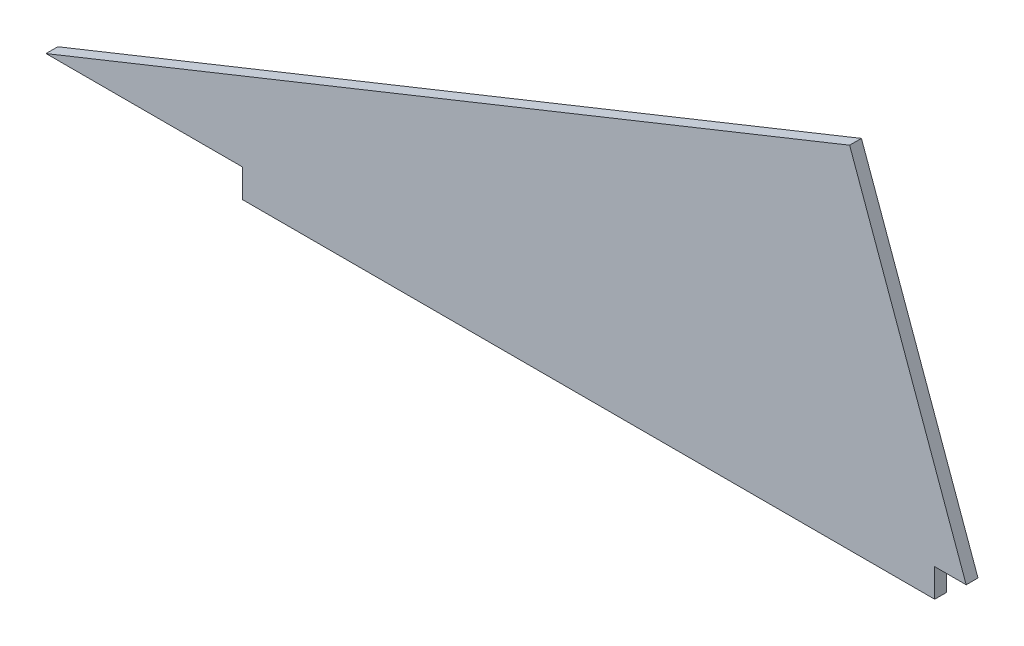
ISO-10303-21;
HEADER;
FILE_DESCRIPTION(('STEP AP214'),'2;1');
FILE_NAME('part.step','',(''),(''),'','','');
FILE_SCHEMA(('AUTOMOTIVE_DESIGN { 1 0 10303 214 1 1 1 1 }'));
ENDSEC;
DATA;
#1=APPLICATION_CONTEXT('core data for automotive mechanical design processes');
#2=APPLICATION_PROTOCOL_DEFINITION('international standard','automotive_design',2000,#1);
#3=PRODUCT_CONTEXT('',#1,'mechanical');
#4=PRODUCT('Part','Part','',(#3));
#5=PRODUCT_RELATED_PRODUCT_CATEGORY('part','',(#4));
#6=PRODUCT_DEFINITION_FORMATION('','',#4);
#7=PRODUCT_DEFINITION_CONTEXT('part definition',#1,'design');
#8=PRODUCT_DEFINITION('design','',#6,#7);
#9=PRODUCT_DEFINITION_SHAPE('','',#8);
#10=(LENGTH_UNIT() NAMED_UNIT(*) SI_UNIT(.MILLI.,.METRE.));
#11=(NAMED_UNIT(*) PLANE_ANGLE_UNIT() SI_UNIT($,.RADIAN.));
#12=(NAMED_UNIT(*) SI_UNIT($,.STERADIAN.) SOLID_ANGLE_UNIT());
#13=UNCERTAINTY_MEASURE_WITH_UNIT(LENGTH_MEASURE(1.E-05),#10,'distance_accuracy_value','');
#14=(GEOMETRIC_REPRESENTATION_CONTEXT(3) GLOBAL_UNCERTAINTY_ASSIGNED_CONTEXT((#13)) GLOBAL_UNIT_ASSIGNED_CONTEXT((#10,
#11,#12)) REPRESENTATION_CONTEXT('',''));
#15=CARTESIAN_POINT('',(0.,0.,0.));
#16=DIRECTION('',(0.,0.,1.));
#17=DIRECTION('',(1.,0.,0.));
#18=AXIS2_PLACEMENT_3D('',#15,#16,#17);
#19=CARTESIAN_POINT('',(358.3,-20.340021117244,4.76));
#20=DIRECTION('',(-1.,0.,0.));
#21=DIRECTION('',(0.,0.,1.));
#22=AXIS2_PLACEMENT_3D('',#19,#20,#21);
#23=PLANE('',#22);
#24=DIRECTION('',(0.,1.,0.));
#25=VECTOR('',#24,1.);
#26=CARTESIAN_POINT('',(358.3,-20.340021117244,0.));
#27=LINE('',#26,#25);
#28=CARTESIAN_POINT('',(358.3,-31.740021117244,0.));
#29=VERTEX_POINT('',#28);
#30=CARTESIAN_POINT('',(358.3,-20.340021117244,0.));
#31=VERTEX_POINT('',#30);
#32=EDGE_CURVE('E123',#29,#31,#27,.T.);
#33=ORIENTED_EDGE('',*,*,#32,.T.);
#34=DIRECTION('',(0.,0.,-1.));
#35=VECTOR('',#34,1.);
#36=CARTESIAN_POINT('',(358.3,-20.340021117244,4.76));
#37=LINE('',#36,#35);
#38=CARTESIAN_POINT('',(358.3,-20.340021117244,4.76));
#39=VERTEX_POINT('',#38);
#40=EDGE_CURVE('E11',#39,#31,#37,.T.);
#41=ORIENTED_EDGE('',*,*,#40,.F.);
#42=DIRECTION('',(0.,1.,0.));
#43=VECTOR('',#42,1.);
#44=CARTESIAN_POINT('',(358.3,-20.340021117244,4.76));
#45=LINE('',#44,#43);
#46=CARTESIAN_POINT('',(358.3,-31.740021117244,4.76));
#47=VERTEX_POINT('',#46);
#48=EDGE_CURVE('E135',#47,#39,#45,.T.);
#49=ORIENTED_EDGE('',*,*,#48,.F.);
#50=DIRECTION('',(0.,0.,-1.));
#51=VECTOR('',#50,1.);
#52=CARTESIAN_POINT('',(358.3,-31.740021117244,4.76));
#53=LINE('',#52,#51);
#54=EDGE_CURVE('E119',#47,#29,#53,.T.);
#55=ORIENTED_EDGE('',*,*,#54,.T.);
#56=EDGE_LOOP('',(#33,#41,#49,#55));
#57=FACE_BOUND('',#56,.T.);
#58=ADVANCED_FACE('F33',(#57),#23,.F.);
#59=CARTESIAN_POINT('',(371.,-20.340021117244,4.76));
#60=DIRECTION('',(0.,1.,0.));
#61=DIRECTION('',(0.,0.,1.));
#62=AXIS2_PLACEMENT_3D('',#59,#60,#61);
#63=PLANE('',#62);
#64=DIRECTION('',(1.,0.,0.));
#65=VECTOR('',#64,1.);
#66=CARTESIAN_POINT('',(371.,-20.340021117244,0.));
#67=LINE('',#66,#65);
#68=CARTESIAN_POINT('',(371.,-20.340021117244,0.));
#69=VERTEX_POINT('',#68);
#70=EDGE_CURVE('E126',#31,#69,#67,.T.);
#71=ORIENTED_EDGE('',*,*,#70,.T.);
#72=DIRECTION('',(0.,0.,-1.));
#73=VECTOR('',#72,1.);
#74=CARTESIAN_POINT('',(371.,-20.340021117244,4.76));
#75=LINE('',#74,#73);
#76=CARTESIAN_POINT('',(371.,-20.340021117244,4.76));
#77=VERTEX_POINT('',#76);
#78=EDGE_CURVE('E41',#77,#69,#75,.T.);
#79=ORIENTED_EDGE('',*,*,#78,.F.);
#80=DIRECTION('',(1.,0.,0.));
#81=VECTOR('',#80,1.);
#82=CARTESIAN_POINT('',(371.,-20.340021117244,4.76));
#83=LINE('',#82,#81);
#84=EDGE_CURVE('E89',#39,#77,#83,.T.);
#85=ORIENTED_EDGE('',*,*,#84,.F.);
#86=ORIENTED_EDGE('',*,*,#40,.T.);
#87=EDGE_LOOP('',(#71,#79,#85,#86));
#88=FACE_BOUND('',#87,.T.);
#89=ADVANCED_FACE('F160',(#88),#63,.F.);
#90=CARTESIAN_POINT('',(371.,-20.340021117244,4.76));
#91=DIRECTION('',(-0.940425446769995,-0.339999969216844,0.));
#92=DIRECTION('',(0.339999969216844,-0.940425446769995,0.));
#93=AXIS2_PLACEMENT_3D('',#90,#91,#92);
#94=PLANE('',#93);
#95=DIRECTION('',(-0.339999969216844,0.940425446769995,0.));
#96=VECTOR('',#95,1.);
#97=CARTESIAN_POINT('',(371.,-20.340021117244,0.));
#98=LINE('',#97,#96);
#99=CARTESIAN_POINT('',(324.,109.659978882756,0.));
#100=VERTEX_POINT('',#99);
#101=EDGE_CURVE('E128',#69,#100,#98,.T.);
#102=ORIENTED_EDGE('',*,*,#101,.T.);
#103=DIRECTION('',(0.,0.,-1.));
#104=VECTOR('',#103,1.);
#105=CARTESIAN_POINT('',(324.,109.659978882756,4.76));
#106=LINE('',#105,#104);
#107=CARTESIAN_POINT('',(324.,109.659978882756,4.76));
#108=VERTEX_POINT('',#107);
#109=EDGE_CURVE('E139',#108,#100,#106,.T.);
#110=ORIENTED_EDGE('',*,*,#109,.F.);
#111=DIRECTION('',(-0.339999969216844,0.940425446769995,0.));
#112=VECTOR('',#111,1.);
#113=CARTESIAN_POINT('',(371.,-20.340021117244,4.76));
#114=LINE('',#113,#112);
#115=EDGE_CURVE('E147',#77,#108,#114,.T.);
#116=ORIENTED_EDGE('',*,*,#115,.F.);
#117=ORIENTED_EDGE('',*,*,#78,.T.);
#118=EDGE_LOOP('',(#102,#110,#116,#117));
#119=FACE_BOUND('',#118,.T.);
#120=ADVANCED_FACE('F145',(#119),#94,.F.);
#121=CARTESIAN_POINT('',(324.,109.659978882756,4.76));
#122=DIRECTION('',(0.372378206798175,-0.928081069250836,0.));
#123=DIRECTION('',(0.928081069250836,0.372378206798175,0.));
#124=AXIS2_PLACEMENT_3D('',#121,#122,#123);
#125=PLANE('',#124);
#126=DIRECTION('',(-0.928081069250836,-0.372378206798175,0.));
#127=VECTOR('',#126,1.);
#128=CARTESIAN_POINT('',(324.,109.659978882756,0.));
#129=LINE('',#128,#127);
#130=CARTESIAN_POINT('',(0.,-20.3400211172441,0.));
#131=VERTEX_POINT('',#130);
#132=EDGE_CURVE('E130',#100,#131,#129,.T.);
#133=ORIENTED_EDGE('',*,*,#132,.T.);
#134=DIRECTION('',(0.,0.,-1.));
#135=VECTOR('',#134,1.);
#136=CARTESIAN_POINT('',(0.,-20.3400211172441,4.76));
#137=LINE('',#136,#135);
#138=CARTESIAN_POINT('',(0.,-20.3400211172441,4.76));
#139=VERTEX_POINT('',#138);
#140=EDGE_CURVE('E114',#139,#131,#137,.T.);
#141=ORIENTED_EDGE('',*,*,#140,.F.);
#142=DIRECTION('',(-0.928081069250836,-0.372378206798175,0.));
#143=VECTOR('',#142,1.);
#144=CARTESIAN_POINT('',(324.,109.659978882756,4.76));
#145=LINE('',#144,#143);
#146=EDGE_CURVE('E105',#108,#139,#145,.T.);
#147=ORIENTED_EDGE('',*,*,#146,.F.);
#148=ORIENTED_EDGE('',*,*,#109,.T.);
#149=EDGE_LOOP('',(#133,#141,#147,#148));
#150=FACE_BOUND('',#149,.T.);
#151=ADVANCED_FACE('F153',(#150),#125,.F.);
#152=CARTESIAN_POINT('',(79.2999999999999,-20.3400211172441,4.76));
#153=DIRECTION('',(0.,1.,0.));
#154=DIRECTION('',(-1.,0.,0.));
#155=AXIS2_PLACEMENT_3D('',#152,#153,#154);
#156=PLANE('',#155);
#157=DIRECTION('',(1.,0.,0.));
#158=VECTOR('',#157,1.);
#159=CARTESIAN_POINT('',(79.2999999999999,-20.3400211172441,0.));
#160=LINE('',#159,#158);
#161=CARTESIAN_POINT('',(79.2999999999999,-20.3400211172441,0.));
#162=VERTEX_POINT('',#161);
#163=EDGE_CURVE('E113',#131,#162,#160,.T.);
#164=ORIENTED_EDGE('',*,*,#163,.T.);
#165=DIRECTION('',(0.,0.,-1.));
#166=VECTOR('',#165,1.);
#167=CARTESIAN_POINT('',(79.2999999999999,-20.3400211172441,4.76));
#168=LINE('',#167,#166);
#169=CARTESIAN_POINT('',(79.2999999999999,-20.3400211172441,4.76));
#170=VERTEX_POINT('',#169);
#171=EDGE_CURVE('E110',#170,#162,#168,.T.);
#172=ORIENTED_EDGE('',*,*,#171,.F.);
#173=DIRECTION('',(1.,0.,0.));
#174=VECTOR('',#173,1.);
#175=CARTESIAN_POINT('',(79.2999999999999,-20.3400211172441,4.76));
#176=LINE('',#175,#174);
#177=EDGE_CURVE('E99',#139,#170,#176,.T.);
#178=ORIENTED_EDGE('',*,*,#177,.F.);
#179=ORIENTED_EDGE('',*,*,#140,.T.);
#180=EDGE_LOOP('',(#164,#172,#178,#179));
#181=FACE_BOUND('',#180,.T.);
#182=ADVANCED_FACE('F111',(#181),#156,.F.);
#183=CARTESIAN_POINT('',(79.2999999999999,-31.740021117244,4.76));
#184=DIRECTION('',(1.,0.,0.));
#185=DIRECTION('',(0.,0.,-1.));
#186=AXIS2_PLACEMENT_3D('',#183,#184,#185);
#187=PLANE('',#186);
#188=DIRECTION('',(0.,-1.,0.));
#189=VECTOR('',#188,1.);
#190=CARTESIAN_POINT('',(79.2999999999999,-31.740021117244,0.));
#191=LINE('',#190,#189);
#192=CARTESIAN_POINT('',(79.2999999999999,-31.740021117244,0.));
#193=VERTEX_POINT('',#192);
#194=EDGE_CURVE('E75',#162,#193,#191,.T.);
#195=ORIENTED_EDGE('',*,*,#194,.T.);
#196=DIRECTION('',(0.,0.,-1.));
#197=VECTOR('',#196,1.);
#198=CARTESIAN_POINT('',(79.2999999999999,-31.740021117244,4.76));
#199=LINE('',#198,#197);
#200=CARTESIAN_POINT('',(79.2999999999999,-31.740021117244,4.76));
#201=VERTEX_POINT('',#200);
#202=EDGE_CURVE('E115',#201,#193,#199,.T.);
#203=ORIENTED_EDGE('',*,*,#202,.F.);
#204=DIRECTION('',(0.,-1.,0.));
#205=VECTOR('',#204,1.);
#206=CARTESIAN_POINT('',(79.2999999999999,-31.740021117244,4.76));
#207=LINE('',#206,#205);
#208=EDGE_CURVE('E103',#170,#201,#207,.T.);
#209=ORIENTED_EDGE('',*,*,#208,.F.);
#210=ORIENTED_EDGE('',*,*,#171,.T.);
#211=EDGE_LOOP('',(#195,#203,#209,#210));
#212=FACE_BOUND('',#211,.T.);
#213=ADVANCED_FACE('F117',(#212),#187,.F.);
#214=CARTESIAN_POINT('',(358.3,-31.740021117244,4.76));
#215=DIRECTION('',(0.,1.,0.));
#216=DIRECTION('',(-1.,0.,0.));
#217=AXIS2_PLACEMENT_3D('',#214,#215,#216);
#218=PLANE('',#217);
#219=DIRECTION('',(1.,0.,0.));
#220=VECTOR('',#219,1.);
#221=CARTESIAN_POINT('',(358.3,-31.740021117244,0.));
#222=LINE('',#221,#220);
#223=EDGE_CURVE('E81',#193,#29,#222,.T.);
#224=ORIENTED_EDGE('',*,*,#223,.T.);
#225=ORIENTED_EDGE('',*,*,#54,.F.);
#226=DIRECTION('',(1.,0.,0.));
#227=VECTOR('',#226,1.);
#228=CARTESIAN_POINT('',(358.3,-31.740021117244,4.76));
#229=LINE('',#228,#227);
#230=EDGE_CURVE('E49',#201,#47,#229,.T.);
#231=ORIENTED_EDGE('',*,*,#230,.F.);
#232=ORIENTED_EDGE('',*,*,#202,.T.);
#233=EDGE_LOOP('',(#224,#225,#231,#232));
#234=FACE_BOUND('',#233,.T.);
#235=ADVANCED_FACE('F174',(#234),#218,.F.);
#236=CARTESIAN_POINT('',(0.,0.,4.76));
#237=DIRECTION('',(0.,0.,-1.));
#238=DIRECTION('',(-1.,0.,0.));
#239=AXIS2_PLACEMENT_3D('',#236,#237,#238);
#240=PLANE('',#239);
#241=ORIENTED_EDGE('',*,*,#48,.T.);
#242=ORIENTED_EDGE('',*,*,#84,.T.);
#243=ORIENTED_EDGE('',*,*,#115,.T.);
#244=ORIENTED_EDGE('',*,*,#146,.T.);
#245=ORIENTED_EDGE('',*,*,#177,.T.);
#246=ORIENTED_EDGE('',*,*,#208,.T.);
#247=ORIENTED_EDGE('',*,*,#230,.T.);
#248=EDGE_LOOP('',(#241,#242,#243,#244,#245,#246,#247));
#249=FACE_BOUND('',#248,.T.);
#250=ADVANCED_FACE('F101',(#249),#240,.F.);
#251=CARTESIAN_POINT('',(0.,0.,0.));
#252=DIRECTION('',(0.,0.,-1.));
#253=DIRECTION('',(-1.,0.,0.));
#254=AXIS2_PLACEMENT_3D('',#251,#252,#253);
#255=PLANE('',#254);
#256=ORIENTED_EDGE('',*,*,#32,.F.);
#257=ORIENTED_EDGE('',*,*,#223,.F.);
#258=ORIENTED_EDGE('',*,*,#194,.F.);
#259=ORIENTED_EDGE('',*,*,#163,.F.);
#260=ORIENTED_EDGE('',*,*,#132,.F.);
#261=ORIENTED_EDGE('',*,*,#101,.F.);
#262=ORIENTED_EDGE('',*,*,#70,.F.);
#263=EDGE_LOOP('',(#256,#257,#258,#259,#260,#261,#262));
#264=FACE_BOUND('',#263,.T.);
#265=ADVANCED_FACE('F151',(#264),#255,.T.);
#266=CLOSED_SHELL('',(#58,#89,#120,#151,#182,#213,#235,#250,#265));
#267=MANIFOLD_SOLID_BREP('B2',#266);
#268=ADVANCED_BREP_SHAPE_REPRESENTATION('',(#18,#267),#14);
#269=SHAPE_DEFINITION_REPRESENTATION(#9,#268);
ENDSEC;
END-ISO-10303-21;
